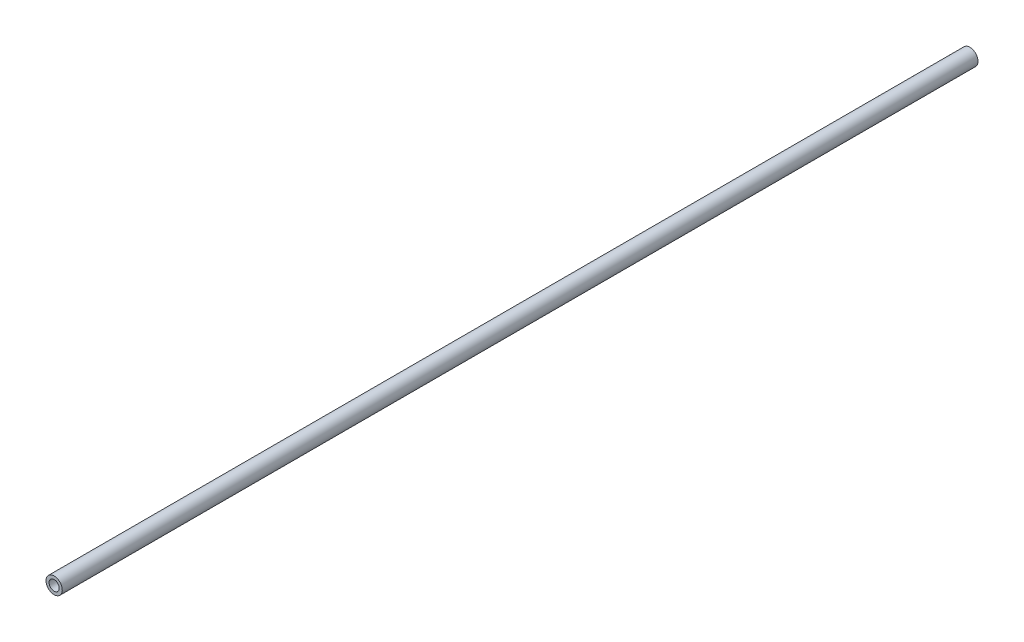
ISO-10303-21;
HEADER;
FILE_DESCRIPTION(('STEP AP214'),'2;1');
FILE_NAME('part.step','',(''),(''),'','','');
FILE_SCHEMA(('AUTOMOTIVE_DESIGN { 1 0 10303 214 1 1 1 1 }'));
ENDSEC;
DATA;
#1=APPLICATION_CONTEXT('core data for automotive mechanical design processes');
#2=APPLICATION_PROTOCOL_DEFINITION('international standard','automotive_design',2000,#1);
#3=PRODUCT_CONTEXT('',#1,'mechanical');
#4=PRODUCT('Part','Part','',(#3));
#5=PRODUCT_RELATED_PRODUCT_CATEGORY('part','',(#4));
#6=PRODUCT_DEFINITION_FORMATION('','',#4);
#7=PRODUCT_DEFINITION_CONTEXT('part definition',#1,'design');
#8=PRODUCT_DEFINITION('design','',#6,#7);
#9=PRODUCT_DEFINITION_SHAPE('','',#8);
#10=(LENGTH_UNIT() NAMED_UNIT(*) SI_UNIT(.MILLI.,.METRE.));
#11=(NAMED_UNIT(*) PLANE_ANGLE_UNIT() SI_UNIT($,.RADIAN.));
#12=(NAMED_UNIT(*) SI_UNIT($,.STERADIAN.) SOLID_ANGLE_UNIT());
#13=UNCERTAINTY_MEASURE_WITH_UNIT(LENGTH_MEASURE(1.E-05),#10,'distance_accuracy_value','');
#14=(GEOMETRIC_REPRESENTATION_CONTEXT(3) GLOBAL_UNCERTAINTY_ASSIGNED_CONTEXT((#13)) GLOBAL_UNIT_ASSIGNED_CONTEXT((#10,
#11,#12)) REPRESENTATION_CONTEXT('',''));
#15=CARTESIAN_POINT('',(0.,0.,0.));
#16=DIRECTION('',(0.,0.,1.));
#17=DIRECTION('',(1.,0.,0.));
#18=AXIS2_PLACEMENT_3D('',#15,#16,#17);
#19=CARTESIAN_POINT('',(0.,0.,450.));
#20=DIRECTION('',(0.,0.,-1.));
#21=DIRECTION('',(-1.,0.,0.));
#22=AXIS2_PLACEMENT_3D('',#19,#20,#21);
#23=CYLINDRICAL_SURFACE('',#22,4.);
#24=CARTESIAN_POINT('',(0.,0.,450.));
#25=DIRECTION('',(0.,0.,1.));
#26=DIRECTION('',(1.,0.,0.));
#27=AXIS2_PLACEMENT_3D('',#24,#25,#26);
#28=CIRCLE('',#27,4.);
#29=CARTESIAN_POINT('',(4.,0.,450.));
#30=VERTEX_POINT('',#29);
#31=EDGE_CURVE('E11',#30,#30,#28,.T.);
#32=ORIENTED_EDGE('',*,*,#31,.F.);
#33=EDGE_LOOP('',(#32));
#34=FACE_BOUND('',#33,.T.);
#35=CARTESIAN_POINT('',(0.,0.,0.));
#36=DIRECTION('',(0.,0.,1.));
#37=DIRECTION('',(1.,0.,0.));
#38=AXIS2_PLACEMENT_3D('',#35,#36,#37);
#39=CIRCLE('',#38,4.);
#40=CARTESIAN_POINT('',(4.,0.,0.));
#41=VERTEX_POINT('',#40);
#42=EDGE_CURVE('E42',#41,#41,#39,.T.);
#43=ORIENTED_EDGE('',*,*,#42,.T.);
#44=EDGE_LOOP('',(#43));
#45=FACE_BOUND('',#44,.T.);
#46=ADVANCED_FACE('F39',(#34,#45),#23,.T.);
#47=CARTESIAN_POINT('',(0.,0.,450.));
#48=DIRECTION('',(0.,0.,1.));
#49=DIRECTION('',(1.,0.,0.));
#50=AXIS2_PLACEMENT_3D('',#47,#48,#49);
#51=PLANE('',#50);
#52=CARTESIAN_POINT('',(0.,0.,450.));
#53=DIRECTION('',(0.,0.,1.));
#54=DIRECTION('',(1.,0.,0.));
#55=AXIS2_PLACEMENT_3D('',#52,#53,#54);
#56=CIRCLE('',#55,2.49999999999979);
#57=CARTESIAN_POINT('',(2.49999999999979,0.,450.));
#58=VERTEX_POINT('',#57);
#59=EDGE_CURVE('E62',#58,#58,#56,.T.);
#60=ORIENTED_EDGE('',*,*,#59,.F.);
#61=EDGE_LOOP('',(#60));
#62=FACE_BOUND('',#61,.T.);
#63=ORIENTED_EDGE('',*,*,#31,.T.);
#64=EDGE_LOOP('',(#63));
#65=FACE_BOUND('',#64,.T.);
#66=ADVANCED_FACE('F81',(#62,#65),#51,.T.);
#67=CARTESIAN_POINT('',(0.,0.,0.));
#68=DIRECTION('',(0.,0.,1.));
#69=DIRECTION('',(1.,0.,0.));
#70=AXIS2_PLACEMENT_3D('',#67,#68,#69);
#71=PLANE('',#70);
#72=CARTESIAN_POINT('',(0.,0.,0.));
#73=DIRECTION('',(0.,0.,-1.));
#74=DIRECTION('',(-1.,0.,0.));
#75=AXIS2_PLACEMENT_3D('',#72,#73,#74);
#76=CIRCLE('',#75,2.5);
#77=CARTESIAN_POINT('',(-2.5,0.,0.));
#78=VERTEX_POINT('',#77);
#79=EDGE_CURVE('E63',#78,#78,#76,.T.);
#80=ORIENTED_EDGE('',*,*,#79,.F.);
#81=EDGE_LOOP('',(#80));
#82=FACE_BOUND('',#81,.T.);
#83=ORIENTED_EDGE('',*,*,#42,.F.);
#84=EDGE_LOOP('',(#83));
#85=FACE_BOUND('',#84,.T.);
#86=ADVANCED_FACE('F78',(#82,#85),#71,.F.);
#87=CARTESIAN_POINT('',(0.,0.,433.));
#88=DIRECTION('',(0.,0.,1.));
#89=DIRECTION('',(1.,0.,0.));
#90=AXIS2_PLACEMENT_3D('',#87,#88,#89);
#91=CONICAL_SURFACE('',#90,2.49999999999979,1.02974425867659);
#92=CARTESIAN_POINT('',(0.,0.,431.497848452431));
#93=VERTEX_POINT('',#92);
#94=VERTEX_LOOP('',#93);
#95=FACE_BOUND('',#94,.T.);
#96=CARTESIAN_POINT('',(0.,0.,433.));
#97=DIRECTION('',(0.,0.,1.));
#98=DIRECTION('',(1.,0.,0.));
#99=AXIS2_PLACEMENT_3D('',#96,#97,#98);
#100=CIRCLE('',#99,2.49999999999979);
#101=CARTESIAN_POINT('',(2.49999999999979,0.,433.));
#102=VERTEX_POINT('',#101);
#103=EDGE_CURVE('E66',#102,#102,#100,.T.);
#104=ORIENTED_EDGE('',*,*,#103,.T.);
#105=EDGE_LOOP('',(#104));
#106=FACE_BOUND('',#105,.T.);
#107=ADVANCED_FACE('F80',(#95,#106),#91,.F.);
#108=CARTESIAN_POINT('',(0.,0.,450.));
#109=DIRECTION('',(0.,0.,1.));
#110=DIRECTION('',(1.,0.,0.));
#111=AXIS2_PLACEMENT_3D('',#108,#109,#110);
#112=CYLINDRICAL_SURFACE('',#111,2.49999999999979);
#113=ORIENTED_EDGE('',*,*,#103,.F.);
#114=EDGE_LOOP('',(#113));
#115=FACE_BOUND('',#114,.T.);
#116=ORIENTED_EDGE('',*,*,#59,.T.);
#117=EDGE_LOOP('',(#116));
#118=FACE_BOUND('',#117,.T.);
#119=ADVANCED_FACE('F56',(#115,#118),#112,.F.);
#120=CARTESIAN_POINT('',(0.,0.,17.));
#121=DIRECTION('',(0.,0.,-1.));
#122=DIRECTION('',(-1.,0.,0.));
#123=AXIS2_PLACEMENT_3D('',#120,#121,#122);
#124=CONICAL_SURFACE('',#123,2.5,1.02974425867665);
#125=CARTESIAN_POINT('',(0.,0.,18.5021515475689));
#126=VERTEX_POINT('',#125);
#127=VERTEX_LOOP('',#126);
#128=FACE_BOUND('',#127,.T.);
#129=CARTESIAN_POINT('',(0.,0.,17.));
#130=DIRECTION('',(0.,0.,-1.));
#131=DIRECTION('',(-1.,0.,0.));
#132=AXIS2_PLACEMENT_3D('',#129,#130,#131);
#133=CIRCLE('',#132,2.5);
#134=CARTESIAN_POINT('',(-2.5,0.,17.));
#135=VERTEX_POINT('',#134);
#136=EDGE_CURVE('E60',#135,#135,#133,.T.);
#137=ORIENTED_EDGE('',*,*,#136,.T.);
#138=EDGE_LOOP('',(#137));
#139=FACE_BOUND('',#138,.T.);
#140=ADVANCED_FACE('F52',(#128,#139),#124,.F.);
#141=CARTESIAN_POINT('',(0.,0.,0.));
#142=DIRECTION('',(0.,0.,-1.));
#143=DIRECTION('',(-1.,0.,0.));
#144=AXIS2_PLACEMENT_3D('',#141,#142,#143);
#145=CYLINDRICAL_SURFACE('',#144,2.5);
#146=ORIENTED_EDGE('',*,*,#136,.F.);
#147=EDGE_LOOP('',(#146));
#148=FACE_BOUND('',#147,.T.);
#149=ORIENTED_EDGE('',*,*,#79,.T.);
#150=EDGE_LOOP('',(#149));
#151=FACE_BOUND('',#150,.T.);
#152=ADVANCED_FACE('F55',(#148,#151),#145,.F.);
#153=CLOSED_SHELL('',(#46,#66,#86,#107,#119,#140,#152));
#154=MANIFOLD_SOLID_BREP('B2',#153);
#155=ADVANCED_BREP_SHAPE_REPRESENTATION('',(#18,#154),#14);
#156=SHAPE_DEFINITION_REPRESENTATION(#9,#155);
ENDSEC;
END-ISO-10303-21;
